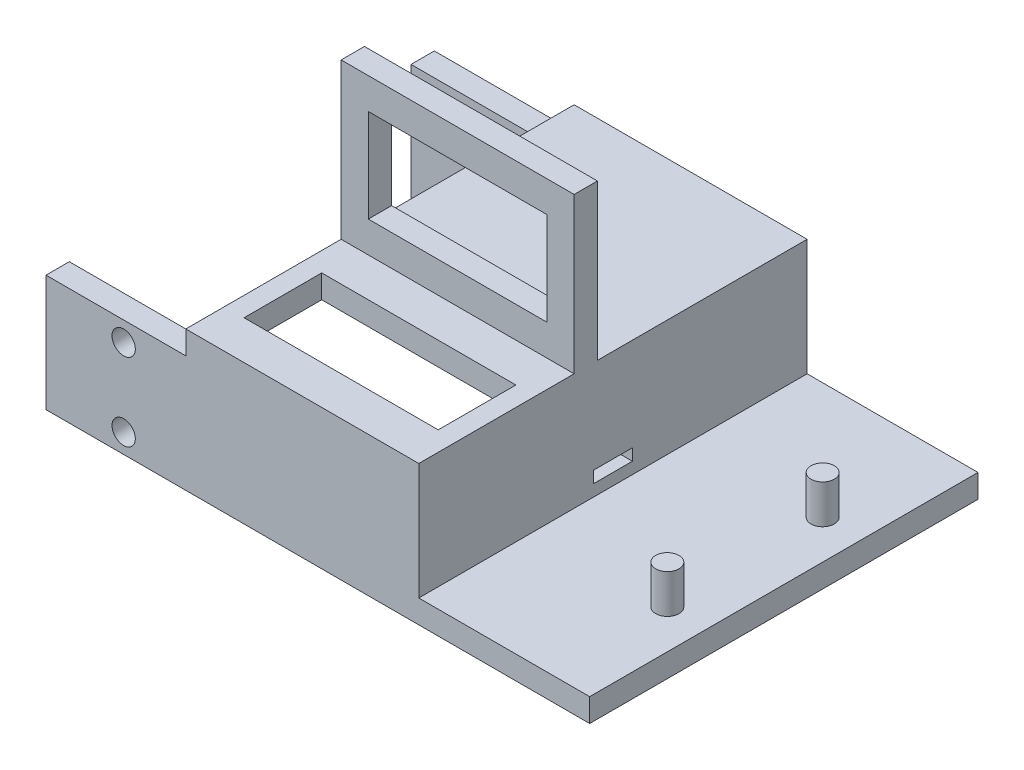
ISO-10303-21;
HEADER;
FILE_DESCRIPTION(('STEP AP214'),'2;1');
FILE_NAME('part.step','',(''),(''),'','','');
FILE_SCHEMA(('AUTOMOTIVE_DESIGN { 1 0 10303 214 1 1 1 1 }'));
ENDSEC;
DATA;
#1=APPLICATION_CONTEXT('core data for automotive mechanical design processes');
#2=APPLICATION_PROTOCOL_DEFINITION('international standard','automotive_design',2000,#1);
#3=PRODUCT_CONTEXT('',#1,'mechanical');
#4=PRODUCT('Part','Part','',(#3));
#5=PRODUCT_RELATED_PRODUCT_CATEGORY('part','',(#4));
#6=PRODUCT_DEFINITION_FORMATION('','',#4);
#7=PRODUCT_DEFINITION_CONTEXT('part definition',#1,'design');
#8=PRODUCT_DEFINITION('design','',#6,#7);
#9=PRODUCT_DEFINITION_SHAPE('','',#8);
#10=(LENGTH_UNIT() NAMED_UNIT(*) SI_UNIT(.MILLI.,.METRE.));
#11=(NAMED_UNIT(*) PLANE_ANGLE_UNIT() SI_UNIT($,.RADIAN.));
#12=(NAMED_UNIT(*) SI_UNIT($,.STERADIAN.) SOLID_ANGLE_UNIT());
#13=UNCERTAINTY_MEASURE_WITH_UNIT(LENGTH_MEASURE(1.E-05),#10,'distance_accuracy_value','');
#14=(GEOMETRIC_REPRESENTATION_CONTEXT(3) GLOBAL_UNCERTAINTY_ASSIGNED_CONTEXT((#13)) GLOBAL_UNIT_ASSIGNED_CONTEXT((#10,
#11,#12)) REPRESENTATION_CONTEXT('',''));
#15=CARTESIAN_POINT('',(0.,0.,0.));
#16=DIRECTION('',(0.,0.,1.));
#17=DIRECTION('',(1.,0.,0.));
#18=AXIS2_PLACEMENT_3D('',#15,#16,#17);
#19=CARTESIAN_POINT('',(0.,18.,0.));
#20=DIRECTION('',(0.,1.,0.));
#21=DIRECTION('',(0.,0.,1.));
#22=AXIS2_PLACEMENT_3D('',#19,#20,#21);
#23=PLANE('',#22);
#24=DIRECTION('',(0.,0.,1.));
#25=VECTOR('',#24,1.);
#26=CARTESIAN_POINT('',(-27.,18.,50.));
#27=LINE('',#26,#25);
#28=CARTESIAN_POINT('',(-27.,18.,0.));
#29=VERTEX_POINT('',#28);
#30=CARTESIAN_POINT('',(-27.,18.,27.));
#31=VERTEX_POINT('',#30);
#32=EDGE_CURVE('E130',#29,#31,#27,.T.);
#33=ORIENTED_EDGE('',*,*,#32,.T.);
#34=DIRECTION('',(1.,0.,0.));
#35=VECTOR('',#34,1.);
#36=CARTESIAN_POINT('',(-27.,18.,27.));
#37=LINE('',#36,#35);
#38=CARTESIAN_POINT('',(3.,18.,27.));
#39=VERTEX_POINT('',#38);
#40=EDGE_CURVE('E329',#31,#39,#37,.T.);
#41=ORIENTED_EDGE('',*,*,#40,.T.);
#42=DIRECTION('',(0.,0.,-1.));
#43=VECTOR('',#42,1.);
#44=CARTESIAN_POINT('',(3.,18.,50.));
#45=LINE('',#44,#43);
#46=CARTESIAN_POINT('',(3.,18.,0.));
#47=VERTEX_POINT('',#46);
#48=EDGE_CURVE('E441',#39,#47,#45,.T.);
#49=ORIENTED_EDGE('',*,*,#48,.T.);
#50=DIRECTION('',(-1.,0.,0.));
#51=VECTOR('',#50,1.);
#52=CARTESIAN_POINT('',(3.,18.,0.));
#53=LINE('',#52,#51);
#54=EDGE_CURVE('E438',#47,#29,#53,.T.);
#55=ORIENTED_EDGE('',*,*,#54,.T.);
#56=EDGE_LOOP('',(#33,#41,#49,#55));
#57=FACE_BOUND('',#56,.T.);
#58=ADVANCED_FACE('F102',(#57),#23,.T.);
#59=CARTESIAN_POINT('',(3.,15.,50.));
#60=DIRECTION('',(0.,-1.,0.));
#61=DIRECTION('',(0.,0.,-1.));
#62=AXIS2_PLACEMENT_3D('',#59,#60,#61);
#63=PLANE('',#62);
#64=DIRECTION('',(0.,0.,1.));
#65=VECTOR('',#64,1.);
#66=CARTESIAN_POINT('',(-27.,15.,50.));
#67=LINE('',#66,#65);
#68=CARTESIAN_POINT('',(-27.,15.,0.));
#69=VERTEX_POINT('',#68);
#70=CARTESIAN_POINT('',(-27.,15.,3.));
#71=VERTEX_POINT('',#70);
#72=EDGE_CURVE('E114',#69,#71,#67,.T.);
#73=ORIENTED_EDGE('',*,*,#72,.F.);
#74=DIRECTION('',(-1.,0.,0.));
#75=VECTOR('',#74,1.);
#76=CARTESIAN_POINT('',(3.,15.,0.));
#77=LINE('',#76,#75);
#78=CARTESIAN_POINT('',(-45.,15.,0.));
#79=VERTEX_POINT('',#78);
#80=EDGE_CURVE('E493',#69,#79,#77,.T.);
#81=ORIENTED_EDGE('',*,*,#80,.T.);
#82=DIRECTION('',(0.,0.,-1.));
#83=VECTOR('',#82,1.);
#84=CARTESIAN_POINT('',(-45.,15.,3.));
#85=LINE('',#84,#83);
#86=CARTESIAN_POINT('',(-45.,15.,3.));
#87=VERTEX_POINT('',#86);
#88=EDGE_CURVE('E534',#87,#79,#85,.T.);
#89=ORIENTED_EDGE('',*,*,#88,.F.);
#90=DIRECTION('',(1.,0.,0.));
#91=VECTOR('',#90,1.);
#92=CARTESIAN_POINT('',(0.,15.,3.));
#93=LINE('',#92,#91);
#94=EDGE_CURVE('E545',#87,#71,#93,.T.);
#95=ORIENTED_EDGE('',*,*,#94,.T.);
#96=EDGE_LOOP('',(#73,#81,#89,#95));
#97=FACE_BOUND('',#96,.T.);
#98=ADVANCED_FACE('F642',(#97),#63,.F.);
#99=CARTESIAN_POINT('',(-27.,15.,47.));
#100=VERTEX_POINT('',#99);
#101=CARTESIAN_POINT('',(-27.,15.,50.));
#102=VERTEX_POINT('',#101);
#103=EDGE_CURVE('E12',#100,#102,#67,.T.);
#104=ORIENTED_EDGE('',*,*,#103,.F.);
#105=DIRECTION('',(-1.,0.,0.));
#106=VECTOR('',#105,1.);
#107=CARTESIAN_POINT('',(0.,15.,47.));
#108=LINE('',#107,#106);
#109=CARTESIAN_POINT('',(-45.,15.,47.));
#110=VERTEX_POINT('',#109);
#111=EDGE_CURVE('E582',#100,#110,#108,.T.);
#112=ORIENTED_EDGE('',*,*,#111,.T.);
#113=DIRECTION('',(0.,0.,1.));
#114=VECTOR('',#113,1.);
#115=CARTESIAN_POINT('',(-45.,15.,47.));
#116=LINE('',#115,#114);
#117=CARTESIAN_POINT('',(-45.,15.,50.));
#118=VERTEX_POINT('',#117);
#119=EDGE_CURVE('E564',#110,#118,#116,.T.);
#120=ORIENTED_EDGE('',*,*,#119,.T.);
#121=DIRECTION('',(-1.,0.,0.));
#122=VECTOR('',#121,1.);
#123=CARTESIAN_POINT('',(3.,15.,50.));
#124=LINE('',#123,#122);
#125=EDGE_CURVE('E505',#102,#118,#124,.T.);
#126=ORIENTED_EDGE('',*,*,#125,.F.);
#127=EDGE_LOOP('',(#104,#112,#120,#126));
#128=FACE_BOUND('',#127,.T.);
#129=ADVANCED_FACE('F702',(#128),#63,.F.);
#130=CARTESIAN_POINT('',(25.,0.,50.));
#131=DIRECTION('',(-1.,0.,0.));
#132=DIRECTION('',(0.,0.,1.));
#133=AXIS2_PLACEMENT_3D('',#130,#131,#132);
#134=PLANE('',#133);
#135=DIRECTION('',(0.,1.,0.));
#136=VECTOR('',#135,1.);
#137=CARTESIAN_POINT('',(25.,0.,0.));
#138=LINE('',#137,#136);
#139=CARTESIAN_POINT('',(25.,0.,0.));
#140=VERTEX_POINT('',#139);
#141=CARTESIAN_POINT('',(25.,3.,0.));
#142=VERTEX_POINT('',#141);
#143=EDGE_CURVE('E500',#140,#142,#138,.T.);
#144=ORIENTED_EDGE('',*,*,#143,.T.);
#145=DIRECTION('',(0.,0.,-1.));
#146=VECTOR('',#145,1.);
#147=CARTESIAN_POINT('',(25.,3.,50.));
#148=LINE('',#147,#146);
#149=CARTESIAN_POINT('',(25.,3.,50.));
#150=VERTEX_POINT('',#149);
#151=EDGE_CURVE('E473',#150,#142,#148,.T.);
#152=ORIENTED_EDGE('',*,*,#151,.F.);
#153=DIRECTION('',(0.,1.,0.));
#154=VECTOR('',#153,1.);
#155=CARTESIAN_POINT('',(25.,0.,50.));
#156=LINE('',#155,#154);
#157=CARTESIAN_POINT('',(25.,0.,50.));
#158=VERTEX_POINT('',#157);
#159=EDGE_CURVE('E492',#158,#150,#156,.T.);
#160=ORIENTED_EDGE('',*,*,#159,.F.);
#161=DIRECTION('',(0.,0.,-1.));
#162=VECTOR('',#161,1.);
#163=CARTESIAN_POINT('',(25.,0.,50.));
#164=LINE('',#163,#162);
#165=EDGE_CURVE('E486',#158,#140,#164,.T.);
#166=ORIENTED_EDGE('',*,*,#165,.T.);
#167=EDGE_LOOP('',(#144,#152,#160,#166));
#168=FACE_BOUND('',#167,.T.);
#169=ADVANCED_FACE('F104',(#168),#134,.F.);
#170=CARTESIAN_POINT('',(25.,3.,50.));
#171=DIRECTION('',(0.,-1.,0.));
#172=DIRECTION('',(1.,0.,0.));
#173=AXIS2_PLACEMENT_3D('',#170,#171,#172);
#174=PLANE('',#173);
#175=CARTESIAN_POINT('',(20.,3.,35.));
#176=DIRECTION('',(0.,-1.,0.));
#177=DIRECTION('',(1.,0.,0.));
#178=AXIS2_PLACEMENT_3D('',#175,#176,#177);
#179=CIRCLE('',#178,1.5);
#180=CARTESIAN_POINT('',(21.5,3.,35.));
#181=VERTEX_POINT('',#180);
#182=EDGE_CURVE('E467',#181,#181,#179,.F.);
#183=ORIENTED_EDGE('',*,*,#182,.F.);
#184=EDGE_LOOP('',(#183));
#185=FACE_BOUND('',#184,.T.);
#186=CARTESIAN_POINT('',(20.,3.,15.));
#187=DIRECTION('',(0.,-1.,0.));
#188=DIRECTION('',(1.,0.,0.));
#189=AXIS2_PLACEMENT_3D('',#186,#187,#188);
#190=CIRCLE('',#189,1.5);
#191=CARTESIAN_POINT('',(21.5,3.,15.));
#192=VERTEX_POINT('',#191);
#193=EDGE_CURVE('E470',#192,#192,#190,.F.);
#194=ORIENTED_EDGE('',*,*,#193,.F.);
#195=EDGE_LOOP('',(#194));
#196=FACE_BOUND('',#195,.T.);
#197=DIRECTION('',(-1.,0.,0.));
#198=VECTOR('',#197,1.);
#199=CARTESIAN_POINT('',(25.,3.,0.));
#200=LINE('',#199,#198);
#201=CARTESIAN_POINT('',(3.,3.,0.));
#202=VERTEX_POINT('',#201);
#203=EDGE_CURVE('E498',#142,#202,#200,.T.);
#204=ORIENTED_EDGE('',*,*,#203,.T.);
#205=DIRECTION('',(0.,0.,-1.));
#206=VECTOR('',#205,1.);
#207=CARTESIAN_POINT('',(3.,3.,50.));
#208=LINE('',#207,#206);
#209=CARTESIAN_POINT('',(3.,3.,50.));
#210=VERTEX_POINT('',#209);
#211=EDGE_CURVE('E476',#210,#202,#208,.T.);
#212=ORIENTED_EDGE('',*,*,#211,.F.);
#213=DIRECTION('',(-1.,0.,0.));
#214=VECTOR('',#213,1.);
#215=CARTESIAN_POINT('',(25.,3.,50.));
#216=LINE('',#215,#214);
#217=EDGE_CURVE('E509',#150,#210,#216,.T.);
#218=ORIENTED_EDGE('',*,*,#217,.F.);
#219=ORIENTED_EDGE('',*,*,#151,.T.);
#220=EDGE_LOOP('',(#204,#212,#218,#219));
#221=FACE_BOUND('',#220,.T.);
#222=ADVANCED_FACE('F630',(#185,#196,#221),#174,.F.);
#223=CARTESIAN_POINT('',(3.,3.,50.));
#224=DIRECTION('',(-1.,0.,0.));
#225=DIRECTION('',(0.,-1.,0.));
#226=AXIS2_PLACEMENT_3D('',#223,#224,#225);
#227=PLANE('',#226);
#228=DIRECTION('',(0.,0.,-1.));
#229=VECTOR('',#228,1.);
#230=CARTESIAN_POINT('',(3.,6.,50.));
#231=LINE('',#230,#229);
#232=CARTESIAN_POINT('',(3.,6.,27.5));
#233=VERTEX_POINT('',#232);
#234=CARTESIAN_POINT('',(3.,6.,22.5));
#235=VERTEX_POINT('',#234);
#236=EDGE_CURVE('E521',#233,#235,#231,.T.);
#237=ORIENTED_EDGE('',*,*,#236,.T.);
#238=DIRECTION('',(0.,-1.,0.));
#239=VECTOR('',#238,1.);
#240=CARTESIAN_POINT('',(3.,3.,22.5));
#241=LINE('',#240,#239);
#242=CARTESIAN_POINT('',(3.,4.5,22.5));
#243=VERTEX_POINT('',#242);
#244=EDGE_CURVE('E518',#235,#243,#241,.T.);
#245=ORIENTED_EDGE('',*,*,#244,.T.);
#246=DIRECTION('',(0.,0.,1.));
#247=VECTOR('',#246,1.);
#248=CARTESIAN_POINT('',(3.,4.5,50.));
#249=LINE('',#248,#247);
#250=CARTESIAN_POINT('',(3.,4.5,27.5));
#251=VERTEX_POINT('',#250);
#252=EDGE_CURVE('E527',#243,#251,#249,.T.);
#253=ORIENTED_EDGE('',*,*,#252,.T.);
#254=DIRECTION('',(0.,1.,0.));
#255=VECTOR('',#254,1.);
#256=CARTESIAN_POINT('',(3.,3.,27.5));
#257=LINE('',#256,#255);
#258=EDGE_CURVE('E524',#251,#233,#257,.T.);
#259=ORIENTED_EDGE('',*,*,#258,.T.);
#260=EDGE_LOOP('',(#237,#245,#253,#259));
#261=FACE_BOUND('',#260,.T.);
#262=DIRECTION('',(0.,1.,0.));
#263=VECTOR('',#262,1.);
#264=CARTESIAN_POINT('',(3.,3.,0.));
#265=LINE('',#264,#263);
#266=EDGE_CURVE('E495',#202,#47,#265,.T.);
#267=ORIENTED_EDGE('',*,*,#266,.T.);
#268=ORIENTED_EDGE('',*,*,#48,.F.);
#269=DIRECTION('',(0.,1.,0.));
#270=VECTOR('',#269,1.);
#271=CARTESIAN_POINT('',(3.,18.,27.));
#272=LINE('',#271,#270);
#273=CARTESIAN_POINT('',(3.00000000000001,38.,27.));
#274=VERTEX_POINT('',#273);
#275=EDGE_CURVE('E368',#39,#274,#272,.T.);
#276=ORIENTED_EDGE('',*,*,#275,.T.);
#277=DIRECTION('',(0.,0.,-1.));
#278=VECTOR('',#277,1.);
#279=CARTESIAN_POINT('',(3.00000000000001,38.,30.));
#280=LINE('',#279,#278);
#281=CARTESIAN_POINT('',(3.00000000000001,38.,30.));
#282=VERTEX_POINT('',#281);
#283=EDGE_CURVE('E390',#282,#274,#280,.T.);
#284=ORIENTED_EDGE('',*,*,#283,.F.);
#285=DIRECTION('',(0.,1.,0.));
#286=VECTOR('',#285,1.);
#287=CARTESIAN_POINT('',(3.,18.,30.));
#288=LINE('',#287,#286);
#289=CARTESIAN_POINT('',(3.,18.,30.));
#290=VERTEX_POINT('',#289);
#291=EDGE_CURVE('E395',#290,#282,#288,.T.);
#292=ORIENTED_EDGE('',*,*,#291,.F.);
#293=CARTESIAN_POINT('',(3.,18.,50.));
#294=VERTEX_POINT('',#293);
#295=EDGE_CURVE('E443',#294,#290,#45,.T.);
#296=ORIENTED_EDGE('',*,*,#295,.F.);
#297=DIRECTION('',(0.,1.,0.));
#298=VECTOR('',#297,1.);
#299=CARTESIAN_POINT('',(3.,3.,50.));
#300=LINE('',#299,#298);
#301=EDGE_CURVE('E507',#210,#294,#300,.T.);
#302=ORIENTED_EDGE('',*,*,#301,.F.);
#303=ORIENTED_EDGE('',*,*,#211,.T.);
#304=EDGE_LOOP('',(#267,#268,#276,#284,#292,#296,#302,#303));
#305=FACE_BOUND('',#304,.T.);
#306=ADVANCED_FACE('F624',(#261,#305),#227,.F.);
#307=DIRECTION('',(0.,0.,-1.));
#308=VECTOR('',#307,1.);
#309=CARTESIAN_POINT('',(0.500000000000002,15.,35.));
#310=LINE('',#309,#308);
#311=CARTESIAN_POINT('',(0.500000000000003,15.,45.));
#312=VERTEX_POINT('',#311);
#313=CARTESIAN_POINT('',(0.500000000000002,15.,35.));
#314=VERTEX_POINT('',#313);
#315=EDGE_CURVE('E363',#312,#314,#310,.T.);
#316=ORIENTED_EDGE('',*,*,#315,.T.);
#317=DIRECTION('',(-1.,0.,0.));
#318=VECTOR('',#317,1.);
#319=CARTESIAN_POINT('',(-24.5,15.,35.));
#320=LINE('',#319,#318);
#321=CARTESIAN_POINT('',(0.,15.,35.));
#322=VERTEX_POINT('',#321);
#323=EDGE_CURVE('E419',#314,#322,#320,.T.);
#324=ORIENTED_EDGE('',*,*,#323,.T.);
#325=DIRECTION('',(0.,0.,-1.));
#326=VECTOR('',#325,1.);
#327=CARTESIAN_POINT('',(0.,15.,50.));
#328=LINE('',#327,#326);
#329=CARTESIAN_POINT('',(0.,15.,45.));
#330=VERTEX_POINT('',#329);
#331=EDGE_CURVE('E482',#330,#322,#328,.T.);
#332=ORIENTED_EDGE('',*,*,#331,.F.);
#333=DIRECTION('',(1.,0.,0.));
#334=VECTOR('',#333,1.);
#335=CARTESIAN_POINT('',(-24.5,15.,45.));
#336=LINE('',#335,#334);
#337=EDGE_CURVE('E112',#330,#312,#336,.T.);
#338=ORIENTED_EDGE('',*,*,#337,.T.);
#339=EDGE_LOOP('',(#316,#324,#332,#338));
#340=FACE_BOUND('',#339,.T.);
#341=ADVANCED_FACE('F661',(#340),#63,.F.);
#342=CARTESIAN_POINT('',(0.,15.,50.));
#343=DIRECTION('',(1.,0.,0.));
#344=DIRECTION('',(0.,1.,0.));
#345=AXIS2_PLACEMENT_3D('',#342,#343,#344);
#346=PLANE('',#345);
#347=DIRECTION('',(0.,0.,-1.));
#348=VECTOR('',#347,1.);
#349=CARTESIAN_POINT('',(0.,4.5,50.));
#350=LINE('',#349,#348);
#351=CARTESIAN_POINT('',(0.,4.5,27.5));
#352=VERTEX_POINT('',#351);
#353=CARTESIAN_POINT('',(0.,4.49999999999999,22.5));
#354=VERTEX_POINT('',#353);
#355=EDGE_CURVE('E464',#352,#354,#350,.T.);
#356=ORIENTED_EDGE('',*,*,#355,.T.);
#357=DIRECTION('',(0.,1.,0.));
#358=VECTOR('',#357,1.);
#359=CARTESIAN_POINT('',(0.,15.,22.5));
#360=LINE('',#359,#358);
#361=CARTESIAN_POINT('',(0.,6.,22.5));
#362=VERTEX_POINT('',#361);
#363=EDGE_CURVE('E455',#354,#362,#360,.T.);
#364=ORIENTED_EDGE('',*,*,#363,.T.);
#365=DIRECTION('',(0.,0.,1.));
#366=VECTOR('',#365,1.);
#367=CARTESIAN_POINT('',(0.,6.,50.));
#368=LINE('',#367,#366);
#369=CARTESIAN_POINT('',(0.,6.,27.5));
#370=VERTEX_POINT('',#369);
#371=EDGE_CURVE('E458',#362,#370,#368,.T.);
#372=ORIENTED_EDGE('',*,*,#371,.T.);
#373=DIRECTION('',(0.,-1.,0.));
#374=VECTOR('',#373,1.);
#375=CARTESIAN_POINT('',(0.,15.,27.5));
#376=LINE('',#375,#374);
#377=EDGE_CURVE('E461',#370,#352,#376,.T.);
#378=ORIENTED_EDGE('',*,*,#377,.T.);
#379=EDGE_LOOP('',(#356,#364,#372,#378));
#380=FACE_BOUND('',#379,.T.);
#381=DIRECTION('',(0.,0.,-1.));
#382=VECTOR('',#381,1.);
#383=CARTESIAN_POINT('',(0.,0.,50.));
#384=LINE('',#383,#382);
#385=CARTESIAN_POINT('',(0.,0.,47.));
#386=VERTEX_POINT('',#385);
#387=CARTESIAN_POINT('',(0.,0.,3.));
#388=VERTEX_POINT('',#387);
#389=EDGE_CURVE('E484',#386,#388,#384,.T.);
#390=ORIENTED_EDGE('',*,*,#389,.F.);
#391=DIRECTION('',(0.,1.,0.));
#392=VECTOR('',#391,1.);
#393=CARTESIAN_POINT('',(0.,15.,47.));
#394=LINE('',#393,#392);
#395=CARTESIAN_POINT('',(0.,15.,47.));
#396=VERTEX_POINT('',#395);
#397=EDGE_CURVE('E573',#386,#396,#394,.T.);
#398=ORIENTED_EDGE('',*,*,#397,.T.);
#399=EDGE_CURVE('E479',#396,#330,#328,.T.);
#400=ORIENTED_EDGE('',*,*,#399,.T.);
#401=ORIENTED_EDGE('',*,*,#331,.T.);
#402=CARTESIAN_POINT('',(0.,15.,3.));
#403=VERTEX_POINT('',#402);
#404=EDGE_CURVE('E483',#322,#403,#328,.T.);
#405=ORIENTED_EDGE('',*,*,#404,.T.);
#406=DIRECTION('',(0.,-1.,0.));
#407=VECTOR('',#406,1.);
#408=CARTESIAN_POINT('',(0.,15.,3.));
#409=LINE('',#408,#407);
#410=EDGE_CURVE('E551',#403,#388,#409,.T.);
#411=ORIENTED_EDGE('',*,*,#410,.T.);
#412=EDGE_LOOP('',(#390,#398,#400,#401,#405,#411));
#413=FACE_BOUND('',#412,.T.);
#414=ADVANCED_FACE('F657',(#380,#413),#346,.F.);
#415=CARTESIAN_POINT('',(0.,0.,50.));
#416=DIRECTION('',(0.,1.,0.));
#417=DIRECTION('',(0.,0.,1.));
#418=AXIS2_PLACEMENT_3D('',#415,#416,#417);
#419=PLANE('',#418);
#420=DIRECTION('',(1.,0.,0.));
#421=VECTOR('',#420,1.);
#422=CARTESIAN_POINT('',(0.,0.,0.));
#423=LINE('',#422,#421);
#424=CARTESIAN_POINT('',(-45.,0.,0.));
#425=VERTEX_POINT('',#424);
#426=EDGE_CURVE('E490',#425,#140,#423,.T.);
#427=ORIENTED_EDGE('',*,*,#426,.T.);
#428=ORIENTED_EDGE('',*,*,#165,.F.);
#429=DIRECTION('',(1.,0.,0.));
#430=VECTOR('',#429,1.);
#431=CARTESIAN_POINT('',(0.,0.,50.));
#432=LINE('',#431,#430);
#433=CARTESIAN_POINT('',(-45.,0.,50.));
#434=VERTEX_POINT('',#433);
#435=EDGE_CURVE('E489',#434,#158,#432,.T.);
#436=ORIENTED_EDGE('',*,*,#435,.F.);
#437=DIRECTION('',(0.,0.,1.));
#438=VECTOR('',#437,1.);
#439=CARTESIAN_POINT('',(-45.,0.,47.));
#440=LINE('',#439,#438);
#441=CARTESIAN_POINT('',(-45.,0.,47.));
#442=VERTEX_POINT('',#441);
#443=EDGE_CURVE('E552',#442,#434,#440,.T.);
#444=ORIENTED_EDGE('',*,*,#443,.F.);
#445=DIRECTION('',(1.,0.,0.));
#446=VECTOR('',#445,1.);
#447=CARTESIAN_POINT('',(0.,0.,47.));
#448=LINE('',#447,#446);
#449=EDGE_CURVE('E567',#442,#386,#448,.T.);
#450=ORIENTED_EDGE('',*,*,#449,.T.);
#451=ORIENTED_EDGE('',*,*,#389,.T.);
#452=DIRECTION('',(-1.,0.,0.));
#453=VECTOR('',#452,1.);
#454=CARTESIAN_POINT('',(0.,0.,3.));
#455=LINE('',#454,#453);
#456=CARTESIAN_POINT('',(-45.,0.,3.));
#457=VERTEX_POINT('',#456);
#458=EDGE_CURVE('E559',#388,#457,#455,.T.);
#459=ORIENTED_EDGE('',*,*,#458,.T.);
#460=DIRECTION('',(0.,0.,-1.));
#461=VECTOR('',#460,1.);
#462=CARTESIAN_POINT('',(-45.,0.,3.));
#463=LINE('',#462,#461);
#464=EDGE_CURVE('E542',#457,#425,#463,.T.);
#465=ORIENTED_EDGE('',*,*,#464,.T.);
#466=EDGE_LOOP('',(#427,#428,#436,#444,#450,#451,#459,#465));
#467=FACE_BOUND('',#466,.T.);
#468=ADVANCED_FACE('F635',(#467),#419,.F.);
#469=CARTESIAN_POINT('',(0.,0.,50.));
#470=DIRECTION('',(0.,0.,1.));
#471=DIRECTION('',(1.,0.,0.));
#472=AXIS2_PLACEMENT_3D('',#469,#470,#471);
#473=PLANE('',#472);
#474=CARTESIAN_POINT('',(-35.,12.5,50.));
#475=DIRECTION('',(0.,0.,1.));
#476=DIRECTION('',(1.,0.,0.));
#477=AXIS2_PLACEMENT_3D('',#474,#475,#476);
#478=CIRCLE('',#477,1.5);
#479=CARTESIAN_POINT('',(-33.5,12.5,50.));
#480=VERTEX_POINT('',#479);
#481=EDGE_CURVE('E574',#480,#480,#478,.T.);
#482=ORIENTED_EDGE('',*,*,#481,.F.);
#483=EDGE_LOOP('',(#482));
#484=FACE_BOUND('',#483,.T.);
#485=CARTESIAN_POINT('',(-35.,2.5,50.));
#486=DIRECTION('',(0.,0.,1.));
#487=DIRECTION('',(1.,0.,0.));
#488=AXIS2_PLACEMENT_3D('',#485,#486,#487);
#489=CIRCLE('',#488,1.5);
#490=CARTESIAN_POINT('',(-33.5,2.5,50.));
#491=VERTEX_POINT('',#490);
#492=EDGE_CURVE('E449',#491,#491,#489,.T.);
#493=ORIENTED_EDGE('',*,*,#492,.F.);
#494=EDGE_LOOP('',(#493));
#495=FACE_BOUND('',#494,.T.);
#496=ORIENTED_EDGE('',*,*,#159,.T.);
#497=ORIENTED_EDGE('',*,*,#217,.T.);
#498=ORIENTED_EDGE('',*,*,#301,.T.);
#499=DIRECTION('',(1.,0.,0.));
#500=VECTOR('',#499,1.);
#501=CARTESIAN_POINT('',(3.,18.,50.));
#502=LINE('',#501,#500);
#503=CARTESIAN_POINT('',(-27.,18.,50.));
#504=VERTEX_POINT('',#503);
#505=EDGE_CURVE('E602',#504,#294,#502,.T.);
#506=ORIENTED_EDGE('',*,*,#505,.F.);
#507=DIRECTION('',(0.,-1.,0.));
#508=VECTOR('',#507,1.);
#509=CARTESIAN_POINT('',(-27.,18.,50.));
#510=LINE('',#509,#508);
#511=EDGE_CURVE('E600',#504,#102,#510,.T.);
#512=ORIENTED_EDGE('',*,*,#511,.T.);
#513=ORIENTED_EDGE('',*,*,#125,.T.);
#514=DIRECTION('',(0.,-1.,0.));
#515=VECTOR('',#514,1.);
#516=CARTESIAN_POINT('',(-45.,15.,50.));
#517=LINE('',#516,#515);
#518=EDGE_CURVE('E570',#118,#434,#517,.T.);
#519=ORIENTED_EDGE('',*,*,#518,.T.);
#520=ORIENTED_EDGE('',*,*,#435,.T.);
#521=EDGE_LOOP('',(#496,#497,#498,#506,#512,#513,#519,#520));
#522=FACE_BOUND('',#521,.T.);
#523=ADVANCED_FACE('F772',(#484,#495,#522),#473,.T.);
#524=CARTESIAN_POINT('',(0.,0.,0.));
#525=DIRECTION('',(0.,0.,1.));
#526=DIRECTION('',(1.,0.,0.));
#527=AXIS2_PLACEMENT_3D('',#524,#525,#526);
#528=PLANE('',#527);
#529=CARTESIAN_POINT('',(-35.,12.5,0.));
#530=DIRECTION('',(0.,0.,1.));
#531=DIRECTION('',(1.,0.,0.));
#532=AXIS2_PLACEMENT_3D('',#529,#530,#531);
#533=CIRCLE('',#532,1.5);
#534=CARTESIAN_POINT('',(-33.5,12.5,0.));
#535=VERTEX_POINT('',#534);
#536=EDGE_CURVE('E454',#535,#535,#533,.T.);
#537=ORIENTED_EDGE('',*,*,#536,.T.);
#538=EDGE_LOOP('',(#537));
#539=FACE_BOUND('',#538,.T.);
#540=CARTESIAN_POINT('',(-35.,2.5,0.));
#541=DIRECTION('',(0.,0.,1.));
#542=DIRECTION('',(-1.,0.,0.));
#543=AXIS2_PLACEMENT_3D('',#540,#541,#542);
#544=CIRCLE('',#543,1.5);
#545=CARTESIAN_POINT('',(-36.5,2.5,0.));
#546=VERTEX_POINT('',#545);
#547=EDGE_CURVE('E593',#546,#546,#544,.T.);
#548=ORIENTED_EDGE('',*,*,#547,.T.);
#549=EDGE_LOOP('',(#548));
#550=FACE_BOUND('',#549,.T.);
#551=ORIENTED_EDGE('',*,*,#143,.F.);
#552=ORIENTED_EDGE('',*,*,#426,.F.);
#553=DIRECTION('',(0.,1.,0.));
#554=VECTOR('',#553,1.);
#555=CARTESIAN_POINT('',(-45.,15.,0.));
#556=LINE('',#555,#554);
#557=EDGE_CURVE('E548',#425,#79,#556,.T.);
#558=ORIENTED_EDGE('',*,*,#557,.T.);
#559=ORIENTED_EDGE('',*,*,#80,.F.);
#560=DIRECTION('',(0.,-1.,0.));
#561=VECTOR('',#560,1.);
#562=CARTESIAN_POINT('',(-27.,18.,0.));
#563=LINE('',#562,#561);
#564=EDGE_CURVE('E596',#29,#69,#563,.T.);
#565=ORIENTED_EDGE('',*,*,#564,.F.);
#566=ORIENTED_EDGE('',*,*,#54,.F.);
#567=ORIENTED_EDGE('',*,*,#266,.F.);
#568=ORIENTED_EDGE('',*,*,#203,.F.);
#569=EDGE_LOOP('',(#551,#552,#558,#559,#565,#566,#567,#568));
#570=FACE_BOUND('',#569,.T.);
#571=ADVANCED_FACE('F616',(#539,#550,#570),#528,.F.);
#572=CARTESIAN_POINT('',(20.,8.,15.));
#573=DIRECTION('',(0.,-1.,0.));
#574=DIRECTION('',(1.,0.,0.));
#575=AXIS2_PLACEMENT_3D('',#572,#573,#574);
#576=CYLINDRICAL_SURFACE('',#575,1.5);
#577=CARTESIAN_POINT('',(20.,8.,15.));
#578=DIRECTION('',(0.,1.,0.));
#579=DIRECTION('',(-1.,0.,0.));
#580=AXIS2_PLACEMENT_3D('',#577,#578,#579);
#581=CIRCLE('',#580,1.5);
#582=CARTESIAN_POINT('',(18.5,8.,15.));
#583=VERTEX_POINT('',#582);
#584=EDGE_CURVE('E503',#583,#583,#581,.T.);
#585=ORIENTED_EDGE('',*,*,#584,.F.);
#586=EDGE_LOOP('',(#585));
#587=FACE_BOUND('',#586,.T.);
#588=ORIENTED_EDGE('',*,*,#193,.T.);
#589=EDGE_LOOP('',(#588));
#590=FACE_BOUND('',#589,.T.);
#591=ADVANCED_FACE('F767',(#587,#590),#576,.T.);
#592=CARTESIAN_POINT('',(20.,8.,15.));
#593=DIRECTION('',(0.,1.,0.));
#594=DIRECTION('',(-1.,0.,0.));
#595=AXIS2_PLACEMENT_3D('',#592,#593,#594);
#596=PLANE('',#595);
#597=ORIENTED_EDGE('',*,*,#584,.T.);
#598=EDGE_LOOP('',(#597));
#599=FACE_BOUND('',#598,.T.);
#600=ADVANCED_FACE('F763',(#599),#596,.T.);
#601=CARTESIAN_POINT('',(20.,8.,35.));
#602=DIRECTION('',(0.,-1.,0.));
#603=DIRECTION('',(1.,0.,0.));
#604=AXIS2_PLACEMENT_3D('',#601,#602,#603);
#605=CYLINDRICAL_SURFACE('',#604,1.5);
#606=CARTESIAN_POINT('',(20.,8.,35.));
#607=DIRECTION('',(0.,1.,0.));
#608=DIRECTION('',(1.,0.,0.));
#609=AXIS2_PLACEMENT_3D('',#606,#607,#608);
#610=CIRCLE('',#609,1.5);
#611=CARTESIAN_POINT('',(21.5,8.,35.));
#612=VERTEX_POINT('',#611);
#613=EDGE_CURVE('E515',#612,#612,#610,.T.);
#614=ORIENTED_EDGE('',*,*,#613,.F.);
#615=EDGE_LOOP('',(#614));
#616=FACE_BOUND('',#615,.T.);
#617=ORIENTED_EDGE('',*,*,#182,.T.);
#618=EDGE_LOOP('',(#617));
#619=FACE_BOUND('',#618,.T.);
#620=ADVANCED_FACE('F759',(#616,#619),#605,.T.);
#621=CARTESIAN_POINT('',(20.,8.,35.));
#622=DIRECTION('',(0.,-1.,0.));
#623=DIRECTION('',(1.,0.,0.));
#624=AXIS2_PLACEMENT_3D('',#621,#622,#623);
#625=PLANE('',#624);
#626=ORIENTED_EDGE('',*,*,#613,.T.);
#627=EDGE_LOOP('',(#626));
#628=FACE_BOUND('',#627,.T.);
#629=ADVANCED_FACE('F755',(#628),#625,.F.);
#630=CARTESIAN_POINT('',(25.,5.99999999999999,22.5));
#631=DIRECTION('',(0.,0.,-1.));
#632=DIRECTION('',(-1.,0.,0.));
#633=AXIS2_PLACEMENT_3D('',#630,#631,#632);
#634=PLANE('',#633);
#635=DIRECTION('',(-1.,0.,0.));
#636=VECTOR('',#635,1.);
#637=CARTESIAN_POINT('',(25.,5.99999999999999,22.5));
#638=LINE('',#637,#636);
#639=EDGE_CURVE('E530',#235,#362,#638,.T.);
#640=ORIENTED_EDGE('',*,*,#639,.T.);
#641=ORIENTED_EDGE('',*,*,#363,.F.);
#642=DIRECTION('',(-1.,0.,0.));
#643=VECTOR('',#642,1.);
#644=CARTESIAN_POINT('',(25.,4.49999999999999,22.5));
#645=LINE('',#644,#643);
#646=EDGE_CURVE('E531',#243,#354,#645,.T.);
#647=ORIENTED_EDGE('',*,*,#646,.F.);
#648=ORIENTED_EDGE('',*,*,#244,.F.);
#649=EDGE_LOOP('',(#640,#641,#647,#648));
#650=FACE_BOUND('',#649,.T.);
#651=ADVANCED_FACE('F745',(#650),#634,.F.);
#652=CARTESIAN_POINT('',(25.,6.,27.5));
#653=DIRECTION('',(0.,1.,0.));
#654=DIRECTION('',(0.,0.,1.));
#655=AXIS2_PLACEMENT_3D('',#652,#653,#654);
#656=PLANE('',#655);
#657=DIRECTION('',(-1.,0.,0.));
#658=VECTOR('',#657,1.);
#659=CARTESIAN_POINT('',(25.,6.,27.5));
#660=LINE('',#659,#658);
#661=EDGE_CURVE('E537',#233,#370,#660,.T.);
#662=ORIENTED_EDGE('',*,*,#661,.T.);
#663=ORIENTED_EDGE('',*,*,#371,.F.);
#664=ORIENTED_EDGE('',*,*,#639,.F.);
#665=ORIENTED_EDGE('',*,*,#236,.F.);
#666=EDGE_LOOP('',(#662,#663,#664,#665));
#667=FACE_BOUND('',#666,.T.);
#668=ADVANCED_FACE('F741',(#667),#656,.F.);
#669=CARTESIAN_POINT('',(25.,6.,27.5));
#670=DIRECTION('',(0.,0.,1.));
#671=DIRECTION('',(1.,0.,0.));
#672=AXIS2_PLACEMENT_3D('',#669,#670,#671);
#673=PLANE('',#672);
#674=DIRECTION('',(-1.,0.,0.));
#675=VECTOR('',#674,1.);
#676=CARTESIAN_POINT('',(25.,4.5,27.5));
#677=LINE('',#676,#675);
#678=EDGE_CURVE('E533',#251,#352,#677,.T.);
#679=ORIENTED_EDGE('',*,*,#678,.T.);
#680=ORIENTED_EDGE('',*,*,#377,.F.);
#681=ORIENTED_EDGE('',*,*,#661,.F.);
#682=ORIENTED_EDGE('',*,*,#258,.F.);
#683=EDGE_LOOP('',(#679,#680,#681,#682));
#684=FACE_BOUND('',#683,.T.);
#685=ADVANCED_FACE('F744',(#684),#673,.F.);
#686=CARTESIAN_POINT('',(25.,4.5,27.5));
#687=DIRECTION('',(0.,-1.,0.));
#688=DIRECTION('',(0.,0.,-1.));
#689=AXIS2_PLACEMENT_3D('',#686,#687,#688);
#690=PLANE('',#689);
#691=ORIENTED_EDGE('',*,*,#646,.T.);
#692=ORIENTED_EDGE('',*,*,#355,.F.);
#693=ORIENTED_EDGE('',*,*,#678,.F.);
#694=ORIENTED_EDGE('',*,*,#252,.F.);
#695=EDGE_LOOP('',(#691,#692,#693,#694));
#696=FACE_BOUND('',#695,.T.);
#697=ADVANCED_FACE('F740',(#696),#690,.F.);
#698=CARTESIAN_POINT('',(-45.,15.,3.));
#699=DIRECTION('',(-1.,0.,0.));
#700=DIRECTION('',(0.,0.,1.));
#701=AXIS2_PLACEMENT_3D('',#698,#699,#700);
#702=PLANE('',#701);
#703=ORIENTED_EDGE('',*,*,#557,.F.);
#704=ORIENTED_EDGE('',*,*,#464,.F.);
#705=DIRECTION('',(0.,1.,0.));
#706=VECTOR('',#705,1.);
#707=CARTESIAN_POINT('',(-45.,15.,3.));
#708=LINE('',#707,#706);
#709=EDGE_CURVE('E556',#457,#87,#708,.T.);
#710=ORIENTED_EDGE('',*,*,#709,.T.);
#711=ORIENTED_EDGE('',*,*,#88,.T.);
#712=EDGE_LOOP('',(#703,#704,#710,#711));
#713=FACE_BOUND('',#712,.T.);
#714=ADVANCED_FACE('F638',(#713),#702,.T.);
#715=CARTESIAN_POINT('',(0.,0.,3.));
#716=DIRECTION('',(0.,0.,-1.));
#717=DIRECTION('',(-1.,0.,0.));
#718=AXIS2_PLACEMENT_3D('',#715,#716,#717);
#719=PLANE('',#718);
#720=CARTESIAN_POINT('',(-35.,12.5,3.));
#721=DIRECTION('',(0.,0.,-1.));
#722=DIRECTION('',(-1.,0.,0.));
#723=AXIS2_PLACEMENT_3D('',#720,#721,#722);
#724=CIRCLE('',#723,1.5);
#725=CARTESIAN_POINT('',(-36.5,12.5,3.));
#726=VERTEX_POINT('',#725);
#727=EDGE_CURVE('E448',#726,#726,#724,.T.);
#728=ORIENTED_EDGE('',*,*,#727,.T.);
#729=EDGE_LOOP('',(#728));
#730=FACE_BOUND('',#729,.T.);
#731=CARTESIAN_POINT('',(-35.,2.5,3.));
#732=DIRECTION('',(0.,0.,-1.));
#733=DIRECTION('',(-1.,0.,0.));
#734=AXIS2_PLACEMENT_3D('',#731,#732,#733);
#735=CIRCLE('',#734,1.5);
#736=CARTESIAN_POINT('',(-36.5,2.5,3.));
#737=VERTEX_POINT('',#736);
#738=EDGE_CURVE('E453',#737,#737,#735,.T.);
#739=ORIENTED_EDGE('',*,*,#738,.T.);
#740=EDGE_LOOP('',(#739));
#741=FACE_BOUND('',#740,.T.);
#742=ORIENTED_EDGE('',*,*,#410,.F.);
#743=EDGE_CURVE('E555',#71,#403,#93,.T.);
#744=ORIENTED_EDGE('',*,*,#743,.F.);
#745=ORIENTED_EDGE('',*,*,#94,.F.);
#746=ORIENTED_EDGE('',*,*,#709,.F.);
#747=ORIENTED_EDGE('',*,*,#458,.F.);
#748=EDGE_LOOP('',(#742,#744,#745,#746,#747));
#749=FACE_BOUND('',#748,.T.);
#750=ADVANCED_FACE('F648',(#730,#741,#749),#719,.F.);
#751=CARTESIAN_POINT('',(-45.,15.,47.));
#752=DIRECTION('',(-1.,0.,0.));
#753=DIRECTION('',(0.,0.,1.));
#754=AXIS2_PLACEMENT_3D('',#751,#752,#753);
#755=PLANE('',#754);
#756=ORIENTED_EDGE('',*,*,#518,.F.);
#757=ORIENTED_EDGE('',*,*,#119,.F.);
#758=DIRECTION('',(0.,-1.,0.));
#759=VECTOR('',#758,1.);
#760=CARTESIAN_POINT('',(-45.,15.,47.));
#761=LINE('',#760,#759);
#762=EDGE_CURVE('E577',#110,#442,#761,.T.);
#763=ORIENTED_EDGE('',*,*,#762,.T.);
#764=ORIENTED_EDGE('',*,*,#443,.T.);
#765=EDGE_LOOP('',(#756,#757,#763,#764));
#766=FACE_BOUND('',#765,.T.);
#767=ADVANCED_FACE('F730',(#766),#755,.T.);
#768=CARTESIAN_POINT('',(0.,0.,47.));
#769=DIRECTION('',(0.,0.,-1.));
#770=DIRECTION('',(-1.,0.,0.));
#771=AXIS2_PLACEMENT_3D('',#768,#769,#770);
#772=PLANE('',#771);
#773=CARTESIAN_POINT('',(-35.,12.5,47.));
#774=DIRECTION('',(0.,0.,-1.));
#775=DIRECTION('',(-1.,0.,0.));
#776=AXIS2_PLACEMENT_3D('',#773,#774,#775);
#777=CIRCLE('',#776,1.5);
#778=CARTESIAN_POINT('',(-36.5,12.5,47.));
#779=VERTEX_POINT('',#778);
#780=EDGE_CURVE('E445',#779,#779,#777,.T.);
#781=ORIENTED_EDGE('',*,*,#780,.F.);
#782=EDGE_LOOP('',(#781));
#783=FACE_BOUND('',#782,.T.);
#784=CARTESIAN_POINT('',(-35.,2.5,47.));
#785=DIRECTION('',(0.,0.,-1.));
#786=DIRECTION('',(-1.,0.,0.));
#787=AXIS2_PLACEMENT_3D('',#784,#785,#786);
#788=CIRCLE('',#787,1.5);
#789=CARTESIAN_POINT('',(-36.5,2.5,47.));
#790=VERTEX_POINT('',#789);
#791=EDGE_CURVE('E450',#790,#790,#788,.T.);
#792=ORIENTED_EDGE('',*,*,#791,.F.);
#793=EDGE_LOOP('',(#792));
#794=FACE_BOUND('',#793,.T.);
#795=ORIENTED_EDGE('',*,*,#397,.F.);
#796=ORIENTED_EDGE('',*,*,#449,.F.);
#797=ORIENTED_EDGE('',*,*,#762,.F.);
#798=ORIENTED_EDGE('',*,*,#111,.F.);
#799=EDGE_CURVE('E580',#396,#100,#108,.T.);
#800=ORIENTED_EDGE('',*,*,#799,.F.);
#801=EDGE_LOOP('',(#795,#796,#797,#798,#800));
#802=FACE_BOUND('',#801,.T.);
#803=ADVANCED_FACE('F726',(#783,#794,#802),#772,.T.);
#804=CARTESIAN_POINT('',(-35.,2.5,0.));
#805=DIRECTION('',(0.,0.,1.));
#806=DIRECTION('',(1.,0.,0.));
#807=AXIS2_PLACEMENT_3D('',#804,#805,#806);
#808=CYLINDRICAL_SURFACE('',#807,1.5);
#809=ORIENTED_EDGE('',*,*,#492,.T.);
#810=EDGE_LOOP('',(#809));
#811=FACE_BOUND('',#810,.T.);
#812=ORIENTED_EDGE('',*,*,#791,.T.);
#813=EDGE_LOOP('',(#812));
#814=FACE_BOUND('',#813,.T.);
#815=ADVANCED_FACE('F722',(#811,#814),#808,.F.);
#816=CARTESIAN_POINT('',(-35.,12.5,0.));
#817=DIRECTION('',(0.,0.,1.));
#818=DIRECTION('',(1.,0.,0.));
#819=AXIS2_PLACEMENT_3D('',#816,#817,#818);
#820=CYLINDRICAL_SURFACE('',#819,1.5);
#821=ORIENTED_EDGE('',*,*,#481,.T.);
#822=EDGE_LOOP('',(#821));
#823=FACE_BOUND('',#822,.T.);
#824=ORIENTED_EDGE('',*,*,#780,.T.);
#825=EDGE_LOOP('',(#824));
#826=FACE_BOUND('',#825,.T.);
#827=ADVANCED_FACE('F719',(#823,#826),#820,.F.);
#828=ORIENTED_EDGE('',*,*,#547,.F.);
#829=EDGE_LOOP('',(#828));
#830=FACE_BOUND('',#829,.T.);
#831=ORIENTED_EDGE('',*,*,#738,.F.);
#832=EDGE_LOOP('',(#831));
#833=FACE_BOUND('',#832,.T.);
#834=ADVANCED_FACE('F716',(#830,#833),#808,.F.);
#835=ORIENTED_EDGE('',*,*,#536,.F.);
#836=EDGE_LOOP('',(#835));
#837=FACE_BOUND('',#836,.T.);
#838=ORIENTED_EDGE('',*,*,#727,.F.);
#839=EDGE_LOOP('',(#838));
#840=FACE_BOUND('',#839,.T.);
#841=ADVANCED_FACE('F712',(#837,#840),#820,.F.);
#842=CARTESIAN_POINT('',(0.,15.,0.));
#843=DIRECTION('',(0.,1.,0.));
#844=DIRECTION('',(0.,0.,1.));
#845=AXIS2_PLACEMENT_3D('',#842,#843,#844);
#846=PLANE('',#845);
#847=EDGE_CURVE('E115',#71,#100,#67,.T.);
#848=ORIENTED_EDGE('',*,*,#847,.F.);
#849=ORIENTED_EDGE('',*,*,#743,.T.);
#850=ORIENTED_EDGE('',*,*,#404,.F.);
#851=CARTESIAN_POINT('',(-24.5,15.,35.));
#852=VERTEX_POINT('',#851);
#853=EDGE_CURVE('E418',#322,#852,#320,.T.);
#854=ORIENTED_EDGE('',*,*,#853,.T.);
#855=DIRECTION('',(0.,0.,1.));
#856=VECTOR('',#855,1.);
#857=CARTESIAN_POINT('',(-24.5,15.,35.));
#858=LINE('',#857,#856);
#859=CARTESIAN_POINT('',(-24.5,15.,45.));
#860=VERTEX_POINT('',#859);
#861=EDGE_CURVE('E422',#852,#860,#858,.T.);
#862=ORIENTED_EDGE('',*,*,#861,.T.);
#863=EDGE_CURVE('E408',#860,#330,#336,.T.);
#864=ORIENTED_EDGE('',*,*,#863,.T.);
#865=ORIENTED_EDGE('',*,*,#399,.F.);
#866=ORIENTED_EDGE('',*,*,#799,.T.);
#867=EDGE_LOOP('',(#848,#849,#850,#854,#862,#864,#865,#866));
#868=FACE_BOUND('',#867,.T.);
#869=ADVANCED_FACE('F652',(#868),#846,.F.);
#870=DIRECTION('',(1.,0.,0.));
#871=VECTOR('',#870,1.);
#872=CARTESIAN_POINT('',(-27.,18.,30.));
#873=LINE('',#872,#871);
#874=CARTESIAN_POINT('',(-27.,18.,30.));
#875=VERTEX_POINT('',#874);
#876=EDGE_CURVE('E122',#875,#290,#873,.T.);
#877=ORIENTED_EDGE('',*,*,#876,.F.);
#878=EDGE_CURVE('E106',#875,#504,#27,.T.);
#879=ORIENTED_EDGE('',*,*,#878,.T.);
#880=ORIENTED_EDGE('',*,*,#505,.T.);
#881=ORIENTED_EDGE('',*,*,#295,.T.);
#882=EDGE_LOOP('',(#877,#879,#880,#881));
#883=FACE_BOUND('',#882,.T.);
#884=DIRECTION('',(-1.,0.,0.));
#885=VECTOR('',#884,1.);
#886=CARTESIAN_POINT('',(-24.5,18.,35.));
#887=LINE('',#886,#885);
#888=CARTESIAN_POINT('',(0.500000000000002,18.,35.));
#889=VERTEX_POINT('',#888);
#890=CARTESIAN_POINT('',(-24.5,18.,35.));
#891=VERTEX_POINT('',#890);
#892=EDGE_CURVE('E407',#889,#891,#887,.T.);
#893=ORIENTED_EDGE('',*,*,#892,.F.);
#894=DIRECTION('',(0.,0.,-1.));
#895=VECTOR('',#894,1.);
#896=CARTESIAN_POINT('',(0.500000000000002,18.,35.));
#897=LINE('',#896,#895);
#898=CARTESIAN_POINT('',(0.500000000000003,18.,45.));
#899=VERTEX_POINT('',#898);
#900=EDGE_CURVE('E405',#899,#889,#897,.T.);
#901=ORIENTED_EDGE('',*,*,#900,.F.);
#902=DIRECTION('',(1.,0.,0.));
#903=VECTOR('',#902,1.);
#904=CARTESIAN_POINT('',(-24.5,18.,45.));
#905=LINE('',#904,#903);
#906=CARTESIAN_POINT('',(-24.5,18.,45.));
#907=VERTEX_POINT('',#906);
#908=EDGE_CURVE('E413',#907,#899,#905,.T.);
#909=ORIENTED_EDGE('',*,*,#908,.F.);
#910=DIRECTION('',(0.,0.,1.));
#911=VECTOR('',#910,1.);
#912=CARTESIAN_POINT('',(-24.5,18.,35.));
#913=LINE('',#912,#911);
#914=EDGE_CURVE('E410',#891,#907,#913,.T.);
#915=ORIENTED_EDGE('',*,*,#914,.F.);
#916=EDGE_LOOP('',(#893,#901,#909,#915));
#917=FACE_BOUND('',#916,.T.);
#918=ADVANCED_FACE('F673',(#883,#917),#23,.T.);
#919=CARTESIAN_POINT('',(-27.,18.,50.));
#920=DIRECTION('',(1.,0.,0.));
#921=DIRECTION('',(0.,0.,-1.));
#922=AXIS2_PLACEMENT_3D('',#919,#920,#921);
#923=PLANE('',#922);
#924=ORIENTED_EDGE('',*,*,#72,.T.);
#925=ORIENTED_EDGE('',*,*,#847,.T.);
#926=ORIENTED_EDGE('',*,*,#103,.T.);
#927=ORIENTED_EDGE('',*,*,#511,.F.);
#928=ORIENTED_EDGE('',*,*,#878,.F.);
#929=DIRECTION('',(0.,1.,0.));
#930=VECTOR('',#929,1.);
#931=CARTESIAN_POINT('',(-27.,18.,30.));
#932=LINE('',#931,#930);
#933=CARTESIAN_POINT('',(-27.,38.,30.));
#934=VERTEX_POINT('',#933);
#935=EDGE_CURVE('E361',#875,#934,#932,.T.);
#936=ORIENTED_EDGE('',*,*,#935,.T.);
#937=DIRECTION('',(0.,0.,-1.));
#938=VECTOR('',#937,1.);
#939=CARTESIAN_POINT('',(-27.,38.,30.));
#940=LINE('',#939,#938);
#941=CARTESIAN_POINT('',(-27.,38.,27.));
#942=VERTEX_POINT('',#941);
#943=EDGE_CURVE('E373',#934,#942,#940,.T.);
#944=ORIENTED_EDGE('',*,*,#943,.T.);
#945=DIRECTION('',(0.,1.,0.));
#946=VECTOR('',#945,1.);
#947=CARTESIAN_POINT('',(-27.,18.,27.));
#948=LINE('',#947,#946);
#949=EDGE_CURVE('E364',#31,#942,#948,.T.);
#950=ORIENTED_EDGE('',*,*,#949,.F.);
#951=ORIENTED_EDGE('',*,*,#32,.F.);
#952=ORIENTED_EDGE('',*,*,#564,.T.);
#953=EDGE_LOOP('',(#924,#925,#926,#927,#928,#936,#944,#950,#951,#952));
#954=FACE_BOUND('',#953,.T.);
#955=ADVANCED_FACE('F619',(#954),#923,.F.);
#956=CARTESIAN_POINT('',(0.500000000000002,18.,35.));
#957=DIRECTION('',(-1.,0.,0.));
#958=DIRECTION('',(0.,0.,1.));
#959=AXIS2_PLACEMENT_3D('',#956,#957,#958);
#960=PLANE('',#959);
#961=ORIENTED_EDGE('',*,*,#315,.F.);
#962=DIRECTION('',(0.,-1.,0.));
#963=VECTOR('',#962,1.);
#964=CARTESIAN_POINT('',(0.500000000000003,18.,45.));
#965=LINE('',#964,#963);
#966=EDGE_CURVE('E415',#899,#312,#965,.T.);
#967=ORIENTED_EDGE('',*,*,#966,.F.);
#968=ORIENTED_EDGE('',*,*,#900,.T.);
#969=DIRECTION('',(0.,-1.,0.));
#970=VECTOR('',#969,1.);
#971=CARTESIAN_POINT('',(0.500000000000002,18.,35.));
#972=LINE('',#971,#970);
#973=EDGE_CURVE('E433',#889,#314,#972,.T.);
#974=ORIENTED_EDGE('',*,*,#973,.T.);
#975=EDGE_LOOP('',(#961,#967,#968,#974));
#976=FACE_BOUND('',#975,.T.);
#977=ADVANCED_FACE('F668',(#976),#960,.T.);
#978=CARTESIAN_POINT('',(-24.5,18.,35.));
#979=DIRECTION('',(0.,0.,1.));
#980=DIRECTION('',(1.,0.,0.));
#981=AXIS2_PLACEMENT_3D('',#978,#979,#980);
#982=PLANE('',#981);
#983=ORIENTED_EDGE('',*,*,#323,.F.);
#984=ORIENTED_EDGE('',*,*,#973,.F.);
#985=ORIENTED_EDGE('',*,*,#892,.T.);
#986=DIRECTION('',(0.,-1.,0.));
#987=VECTOR('',#986,1.);
#988=CARTESIAN_POINT('',(-24.5,18.,35.));
#989=LINE('',#988,#987);
#990=EDGE_CURVE('E430',#891,#852,#989,.T.);
#991=ORIENTED_EDGE('',*,*,#990,.T.);
#992=ORIENTED_EDGE('',*,*,#853,.F.);
#993=EDGE_LOOP('',(#983,#984,#985,#991,#992));
#994=FACE_BOUND('',#993,.T.);
#995=ADVANCED_FACE('F665',(#994),#982,.T.);
#996=CARTESIAN_POINT('',(-24.5,18.,35.));
#997=DIRECTION('',(1.,0.,0.));
#998=DIRECTION('',(0.,0.,-1.));
#999=AXIS2_PLACEMENT_3D('',#996,#997,#998);
#1000=PLANE('',#999);
#1001=ORIENTED_EDGE('',*,*,#861,.F.);
#1002=ORIENTED_EDGE('',*,*,#990,.F.);
#1003=ORIENTED_EDGE('',*,*,#914,.T.);
#1004=DIRECTION('',(0.,-1.,0.));
#1005=VECTOR('',#1004,1.);
#1006=CARTESIAN_POINT('',(-24.5,18.,45.));
#1007=LINE('',#1006,#1005);
#1008=EDGE_CURVE('E428',#907,#860,#1007,.T.);
#1009=ORIENTED_EDGE('',*,*,#1008,.T.);
#1010=EDGE_LOOP('',(#1001,#1002,#1003,#1009));
#1011=FACE_BOUND('',#1010,.T.);
#1012=ADVANCED_FACE('F678',(#1011),#1000,.T.);
#1013=CARTESIAN_POINT('',(-24.5,18.,45.));
#1014=DIRECTION('',(0.,0.,-1.));
#1015=DIRECTION('',(-1.,0.,0.));
#1016=AXIS2_PLACEMENT_3D('',#1013,#1014,#1015);
#1017=PLANE('',#1016);
#1018=ORIENTED_EDGE('',*,*,#863,.F.);
#1019=ORIENTED_EDGE('',*,*,#1008,.F.);
#1020=ORIENTED_EDGE('',*,*,#908,.T.);
#1021=ORIENTED_EDGE('',*,*,#966,.T.);
#1022=ORIENTED_EDGE('',*,*,#337,.F.);
#1023=EDGE_LOOP('',(#1018,#1019,#1020,#1021,#1022));
#1024=FACE_BOUND('',#1023,.T.);
#1025=ADVANCED_FACE('F682',(#1024),#1017,.T.);
#1026=CARTESIAN_POINT('',(0.,0.,27.));
#1027=DIRECTION('',(0.,0.,1.));
#1028=DIRECTION('',(1.,0.,0.));
#1029=AXIS2_PLACEMENT_3D('',#1026,#1027,#1028);
#1030=PLANE('',#1029);
#1031=DIRECTION('',(0.,-1.,0.));
#1032=VECTOR('',#1031,1.);
#1033=CARTESIAN_POINT('',(-0.500000000000004,34.,27.));
#1034=LINE('',#1033,#1032);
#1035=CARTESIAN_POINT('',(-0.500000000000004,34.,27.));
#1036=VERTEX_POINT('',#1035);
#1037=CARTESIAN_POINT('',(-0.500000000000004,22.,27.));
#1038=VERTEX_POINT('',#1037);
#1039=EDGE_CURVE('E349',#1036,#1038,#1034,.T.);
#1040=ORIENTED_EDGE('',*,*,#1039,.F.);
#1041=DIRECTION('',(1.,0.,0.));
#1042=VECTOR('',#1041,1.);
#1043=CARTESIAN_POINT('',(-23.5,34.,27.));
#1044=LINE('',#1043,#1042);
#1045=CARTESIAN_POINT('',(-23.5,34.,27.));
#1046=VERTEX_POINT('',#1045);
#1047=EDGE_CURVE('E327',#1046,#1036,#1044,.T.);
#1048=ORIENTED_EDGE('',*,*,#1047,.F.);
#1049=DIRECTION('',(0.,-1.,0.));
#1050=VECTOR('',#1049,1.);
#1051=CARTESIAN_POINT('',(-23.5,34.,27.));
#1052=LINE('',#1051,#1050);
#1053=CARTESIAN_POINT('',(-23.5,22.,27.));
#1054=VERTEX_POINT('',#1053);
#1055=EDGE_CURVE('E317',#1046,#1054,#1052,.T.);
#1056=ORIENTED_EDGE('',*,*,#1055,.T.);
#1057=DIRECTION('',(1.,0.,0.));
#1058=VECTOR('',#1057,1.);
#1059=CARTESIAN_POINT('',(-23.5,22.,27.));
#1060=LINE('',#1059,#1058);
#1061=EDGE_CURVE('E302',#1054,#1038,#1060,.T.);
#1062=ORIENTED_EDGE('',*,*,#1061,.T.);
#1063=EDGE_LOOP('',(#1040,#1048,#1056,#1062));
#1064=FACE_BOUND('',#1063,.T.);
#1065=ORIENTED_EDGE('',*,*,#949,.T.);
#1066=DIRECTION('',(1.,0.,0.));
#1067=VECTOR('',#1066,1.);
#1068=CARTESIAN_POINT('',(-27.,38.,27.));
#1069=LINE('',#1068,#1067);
#1070=EDGE_CURVE('E378',#942,#274,#1069,.T.);
#1071=ORIENTED_EDGE('',*,*,#1070,.T.);
#1072=ORIENTED_EDGE('',*,*,#275,.F.);
#1073=ORIENTED_EDGE('',*,*,#40,.F.);
#1074=EDGE_LOOP('',(#1065,#1071,#1072,#1073));
#1075=FACE_BOUND('',#1074,.T.);
#1076=ADVANCED_FACE('F325',(#1064,#1075),#1030,.F.);
#1077=CARTESIAN_POINT('',(0.,0.,30.));
#1078=DIRECTION('',(0.,0.,1.));
#1079=DIRECTION('',(1.,0.,0.));
#1080=AXIS2_PLACEMENT_3D('',#1077,#1078,#1079);
#1081=PLANE('',#1080);
#1082=DIRECTION('',(1.,0.,0.));
#1083=VECTOR('',#1082,1.);
#1084=CARTESIAN_POINT('',(-23.5,34.,30.));
#1085=LINE('',#1084,#1083);
#1086=CARTESIAN_POINT('',(-23.5,34.,30.));
#1087=VERTEX_POINT('',#1086);
#1088=CARTESIAN_POINT('',(-0.500000000000004,34.,30.));
#1089=VERTEX_POINT('',#1088);
#1090=EDGE_CURVE('E358',#1087,#1089,#1085,.T.);
#1091=ORIENTED_EDGE('',*,*,#1090,.T.);
#1092=DIRECTION('',(0.,-1.,0.));
#1093=VECTOR('',#1092,1.);
#1094=CARTESIAN_POINT('',(-0.500000000000004,34.,30.));
#1095=LINE('',#1094,#1093);
#1096=CARTESIAN_POINT('',(-0.500000000000004,22.,30.));
#1097=VERTEX_POINT('',#1096);
#1098=EDGE_CURVE('E344',#1089,#1097,#1095,.T.);
#1099=ORIENTED_EDGE('',*,*,#1098,.T.);
#1100=DIRECTION('',(1.,0.,0.));
#1101=VECTOR('',#1100,1.);
#1102=CARTESIAN_POINT('',(-23.5,22.,30.));
#1103=LINE('',#1102,#1101);
#1104=CARTESIAN_POINT('',(-23.5,22.,30.));
#1105=VERTEX_POINT('',#1104);
#1106=EDGE_CURVE('E322',#1105,#1097,#1103,.T.);
#1107=ORIENTED_EDGE('',*,*,#1106,.F.);
#1108=DIRECTION('',(0.,-1.,0.));
#1109=VECTOR('',#1108,1.);
#1110=CARTESIAN_POINT('',(-23.5,34.,30.));
#1111=LINE('',#1110,#1109);
#1112=EDGE_CURVE('E320',#1087,#1105,#1111,.T.);
#1113=ORIENTED_EDGE('',*,*,#1112,.F.);
#1114=EDGE_LOOP('',(#1091,#1099,#1107,#1113));
#1115=FACE_BOUND('',#1114,.T.);
#1116=ORIENTED_EDGE('',*,*,#935,.F.);
#1117=ORIENTED_EDGE('',*,*,#876,.T.);
#1118=ORIENTED_EDGE('',*,*,#291,.T.);
#1119=DIRECTION('',(1.,0.,0.));
#1120=VECTOR('',#1119,1.);
#1121=CARTESIAN_POINT('',(-27.,38.,30.));
#1122=LINE('',#1121,#1120);
#1123=EDGE_CURVE('E371',#934,#282,#1122,.T.);
#1124=ORIENTED_EDGE('',*,*,#1123,.F.);
#1125=EDGE_LOOP('',(#1116,#1117,#1118,#1124));
#1126=FACE_BOUND('',#1125,.T.);
#1127=ADVANCED_FACE('F690',(#1115,#1126),#1081,.T.);
#1128=CARTESIAN_POINT('',(-27.,38.,30.));
#1129=DIRECTION('',(0.,1.,0.));
#1130=DIRECTION('',(0.,0.,1.));
#1131=AXIS2_PLACEMENT_3D('',#1128,#1129,#1130);
#1132=PLANE('',#1131);
#1133=ORIENTED_EDGE('',*,*,#1070,.F.);
#1134=ORIENTED_EDGE('',*,*,#943,.F.);
#1135=ORIENTED_EDGE('',*,*,#1123,.T.);
#1136=ORIENTED_EDGE('',*,*,#283,.T.);
#1137=EDGE_LOOP('',(#1133,#1134,#1135,#1136));
#1138=FACE_BOUND('',#1137,.T.);
#1139=ADVANCED_FACE('F685',(#1138),#1132,.T.);
#1140=CARTESIAN_POINT('',(-23.5,34.,30.));
#1141=DIRECTION('',(0.,1.,0.));
#1142=DIRECTION('',(0.,0.,1.));
#1143=AXIS2_PLACEMENT_3D('',#1140,#1141,#1142);
#1144=PLANE('',#1143);
#1145=ORIENTED_EDGE('',*,*,#1047,.T.);
#1146=DIRECTION('',(0.,0.,-1.));
#1147=VECTOR('',#1146,1.);
#1148=CARTESIAN_POINT('',(-0.500000000000004,34.,30.));
#1149=LINE('',#1148,#1147);
#1150=EDGE_CURVE('E353',#1089,#1036,#1149,.T.);
#1151=ORIENTED_EDGE('',*,*,#1150,.F.);
#1152=ORIENTED_EDGE('',*,*,#1090,.F.);
#1153=DIRECTION('',(0.,0.,-1.));
#1154=VECTOR('',#1153,1.);
#1155=CARTESIAN_POINT('',(-23.5,34.,30.));
#1156=LINE('',#1155,#1154);
#1157=EDGE_CURVE('E338',#1087,#1046,#1156,.T.);
#1158=ORIENTED_EDGE('',*,*,#1157,.T.);
#1159=EDGE_LOOP('',(#1145,#1151,#1152,#1158));
#1160=FACE_BOUND('',#1159,.T.);
#1161=ADVANCED_FACE('F694',(#1160),#1144,.F.);
#1162=CARTESIAN_POINT('',(-0.500000000000004,34.,30.));
#1163=DIRECTION('',(1.,0.,0.));
#1164=DIRECTION('',(0.,0.,-1.));
#1165=AXIS2_PLACEMENT_3D('',#1162,#1163,#1164);
#1166=PLANE('',#1165);
#1167=ORIENTED_EDGE('',*,*,#1039,.T.);
#1168=DIRECTION('',(0.,0.,-1.));
#1169=VECTOR('',#1168,1.);
#1170=CARTESIAN_POINT('',(-0.500000000000004,22.,30.));
#1171=LINE('',#1170,#1169);
#1172=EDGE_CURVE('E308',#1097,#1038,#1171,.T.);
#1173=ORIENTED_EDGE('',*,*,#1172,.F.);
#1174=ORIENTED_EDGE('',*,*,#1098,.F.);
#1175=ORIENTED_EDGE('',*,*,#1150,.T.);
#1176=EDGE_LOOP('',(#1167,#1173,#1174,#1175));
#1177=FACE_BOUND('',#1176,.T.);
#1178=ADVANCED_FACE('F826',(#1177),#1166,.F.);
#1179=CARTESIAN_POINT('',(-23.5,34.,30.));
#1180=DIRECTION('',(1.,0.,0.));
#1181=DIRECTION('',(0.,0.,-1.));
#1182=AXIS2_PLACEMENT_3D('',#1179,#1180,#1181);
#1183=PLANE('',#1182);
#1184=ORIENTED_EDGE('',*,*,#1055,.F.);
#1185=ORIENTED_EDGE('',*,*,#1157,.F.);
#1186=ORIENTED_EDGE('',*,*,#1112,.T.);
#1187=DIRECTION('',(0.,0.,-1.));
#1188=VECTOR('',#1187,1.);
#1189=CARTESIAN_POINT('',(-23.5,22.,30.));
#1190=LINE('',#1189,#1188);
#1191=EDGE_CURVE('E305',#1105,#1054,#1190,.T.);
#1192=ORIENTED_EDGE('',*,*,#1191,.T.);
#1193=EDGE_LOOP('',(#1184,#1185,#1186,#1192));
#1194=FACE_BOUND('',#1193,.T.);
#1195=ADVANCED_FACE('F315',(#1194),#1183,.T.);
#1196=CARTESIAN_POINT('',(-23.5,22.,30.));
#1197=DIRECTION('',(0.,1.,0.));
#1198=DIRECTION('',(0.,0.,1.));
#1199=AXIS2_PLACEMENT_3D('',#1196,#1197,#1198);
#1200=PLANE('',#1199);
#1201=ORIENTED_EDGE('',*,*,#1061,.F.);
#1202=ORIENTED_EDGE('',*,*,#1191,.F.);
#1203=ORIENTED_EDGE('',*,*,#1106,.T.);
#1204=ORIENTED_EDGE('',*,*,#1172,.T.);
#1205=EDGE_LOOP('',(#1201,#1202,#1203,#1204));
#1206=FACE_BOUND('',#1205,.T.);
#1207=ADVANCED_FACE('F304',(#1206),#1200,.T.);
#1208=CLOSED_SHELL('',(#58,#98,#129,#169,#222,#306,#341,#414,#468,#523,#571,#591,#600,#620,#629,
#651,#668,#685,#697,#714,#750,#767,#803,#815,#827,#834,#841,#869,#918,#955,#977,#995,#1012,
#1025,#1076,#1127,#1139,#1161,#1178,#1195,#1207));
#1209=MANIFOLD_SOLID_BREP('B2',#1208);
#1210=ADVANCED_BREP_SHAPE_REPRESENTATION('',(#18,#1209),#14);
#1211=SHAPE_DEFINITION_REPRESENTATION(#9,#1210);
ENDSEC;
END-ISO-10303-21;
